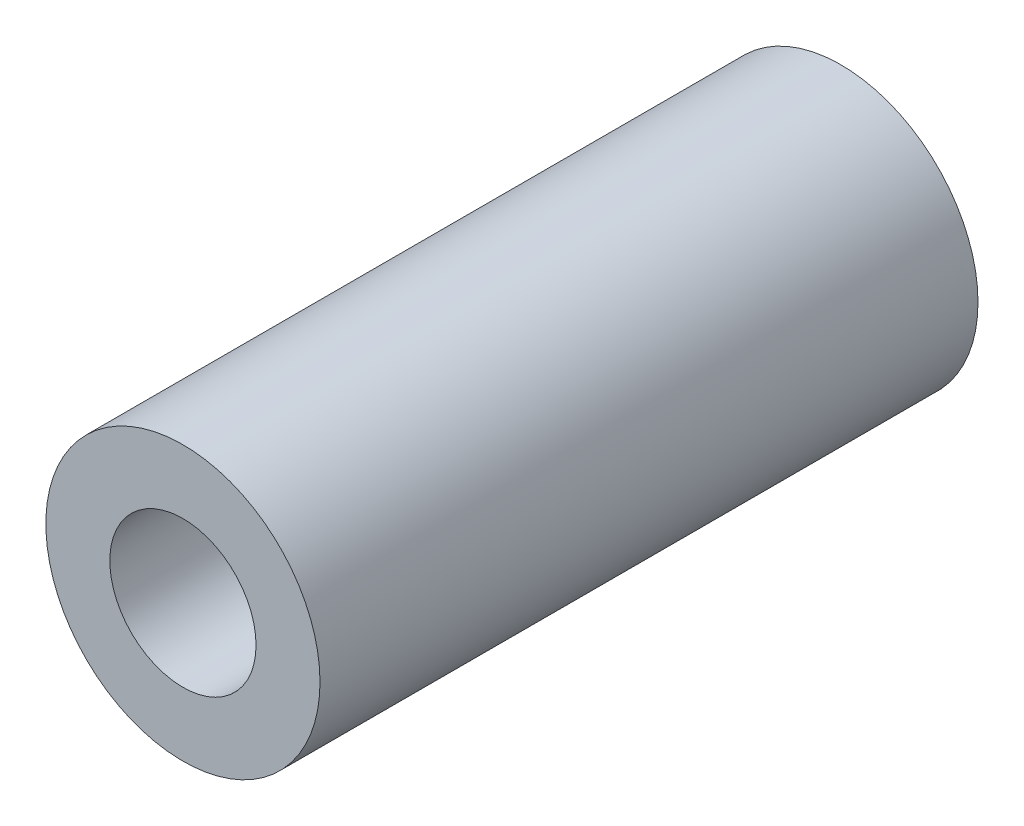
ISO-10303-21;
HEADER;
FILE_DESCRIPTION(('STEP AP214'),'2;1');
FILE_NAME('part.step','',(''),(''),'','','');
FILE_SCHEMA(('AUTOMOTIVE_DESIGN { 1 0 10303 214 1 1 1 1 }'));
ENDSEC;
DATA;
#1=APPLICATION_CONTEXT('core data for automotive mechanical design processes');
#2=APPLICATION_PROTOCOL_DEFINITION('international standard','automotive_design',2000,#1);
#3=PRODUCT_CONTEXT('',#1,'mechanical');
#4=PRODUCT('Part','Part','',(#3));
#5=PRODUCT_RELATED_PRODUCT_CATEGORY('part','',(#4));
#6=PRODUCT_DEFINITION_FORMATION('','',#4);
#7=PRODUCT_DEFINITION_CONTEXT('part definition',#1,'design');
#8=PRODUCT_DEFINITION('design','',#6,#7);
#9=PRODUCT_DEFINITION_SHAPE('','',#8);
#10=(LENGTH_UNIT() NAMED_UNIT(*) SI_UNIT(.MILLI.,.METRE.));
#11=(NAMED_UNIT(*) PLANE_ANGLE_UNIT() SI_UNIT($,.RADIAN.));
#12=(NAMED_UNIT(*) SI_UNIT($,.STERADIAN.) SOLID_ANGLE_UNIT());
#13=UNCERTAINTY_MEASURE_WITH_UNIT(LENGTH_MEASURE(1.E-05),#10,'distance_accuracy_value','');
#14=(GEOMETRIC_REPRESENTATION_CONTEXT(3) GLOBAL_UNCERTAINTY_ASSIGNED_CONTEXT((#13)) GLOBAL_UNIT_ASSIGNED_CONTEXT((#10,
#11,#12)) REPRESENTATION_CONTEXT('',''));
#15=CARTESIAN_POINT('',(0.,0.,0.));
#16=DIRECTION('',(0.,0.,1.));
#17=DIRECTION('',(1.,0.,0.));
#18=AXIS2_PLACEMENT_3D('',#15,#16,#17);
#19=CARTESIAN_POINT('',(-17.9008175763552,104.015877234179,91.3353724199519));
#20=DIRECTION('',(0.,0.,1.));
#21=DIRECTION('',(1.,0.,0.));
#22=AXIS2_PLACEMENT_3D('',#19,#20,#21);
#23=PLANE('',#22);
#24=CARTESIAN_POINT('',(-17.9008175763552,104.015877234179,91.3353724199519));
#25=DIRECTION('',(0.,0.,1.));
#26=DIRECTION('',(1.,0.,0.));
#27=AXIS2_PLACEMENT_3D('',#24,#25,#26);
#28=CIRCLE('',#27,3.75);
#29=CARTESIAN_POINT('',(-14.1508175763552,104.015877234179,91.3353724199519));
#30=VERTEX_POINT('',#29);
#31=EDGE_CURVE('E10',#30,#30,#28,.T.);
#32=ORIENTED_EDGE('',*,*,#31,.T.);
#33=EDGE_LOOP('',(#32));
#34=FACE_BOUND('',#33,.T.);
#35=CARTESIAN_POINT('',(-17.9008175763552,104.015877234179,91.3353724199519));
#36=DIRECTION('',(0.,0.,1.));
#37=DIRECTION('',(1.,0.,0.));
#38=AXIS2_PLACEMENT_3D('',#35,#36,#37);
#39=CIRCLE('',#38,2.0000038100075);
#40=CARTESIAN_POINT('',(-15.9008137663477,104.015877234179,91.3353724199519));
#41=VERTEX_POINT('',#40);
#42=EDGE_CURVE('E42',#41,#41,#39,.T.);
#43=ORIENTED_EDGE('',*,*,#42,.F.);
#44=EDGE_LOOP('',(#43));
#45=FACE_BOUND('',#44,.T.);
#46=ADVANCED_FACE('F31',(#34,#45),#23,.T.);
#47=CARTESIAN_POINT('',(-17.9008175763552,104.015877234179,73.3353724199519));
#48=DIRECTION('',(0.,0.,1.));
#49=DIRECTION('',(1.,0.,0.));
#50=AXIS2_PLACEMENT_3D('',#47,#48,#49);
#51=PLANE('',#50);
#52=CARTESIAN_POINT('',(-17.9008175763552,104.015877234179,73.3353724199519));
#53=DIRECTION('',(0.,0.,1.));
#54=DIRECTION('',(1.,0.,0.));
#55=AXIS2_PLACEMENT_3D('',#52,#53,#54);
#56=CIRCLE('',#55,3.75);
#57=CARTESIAN_POINT('',(-14.1508175763552,104.015877234179,73.3353724199519));
#58=VERTEX_POINT('',#57);
#59=EDGE_CURVE('E35',#58,#58,#56,.T.);
#60=ORIENTED_EDGE('',*,*,#59,.F.);
#61=EDGE_LOOP('',(#60));
#62=FACE_BOUND('',#61,.T.);
#63=CARTESIAN_POINT('',(-17.9008175763552,104.015877234179,73.3353724199519));
#64=DIRECTION('',(0.,0.,1.));
#65=DIRECTION('',(1.,0.,0.));
#66=AXIS2_PLACEMENT_3D('',#63,#64,#65);
#67=CIRCLE('',#66,2.0000038100075);
#68=CARTESIAN_POINT('',(-15.9008137663477,104.015877234179,73.3353724199519));
#69=VERTEX_POINT('',#68);
#70=EDGE_CURVE('E44',#69,#69,#67,.T.);
#71=ORIENTED_EDGE('',*,*,#70,.T.);
#72=EDGE_LOOP('',(#71));
#73=FACE_BOUND('',#72,.T.);
#74=ADVANCED_FACE('F54',(#62,#73),#51,.F.);
#75=CARTESIAN_POINT('',(-17.9008175763552,104.015877234179,91.3353724199519));
#76=DIRECTION('',(0.,0.,-1.));
#77=DIRECTION('',(-1.,0.,0.));
#78=AXIS2_PLACEMENT_3D('',#75,#76,#77);
#79=CYLINDRICAL_SURFACE('',#78,3.75);
#80=ORIENTED_EDGE('',*,*,#31,.F.);
#81=EDGE_LOOP('',(#80));
#82=FACE_BOUND('',#81,.T.);
#83=ORIENTED_EDGE('',*,*,#59,.T.);
#84=EDGE_LOOP('',(#83));
#85=FACE_BOUND('',#84,.T.);
#86=ADVANCED_FACE('F33',(#82,#85),#79,.T.);
#87=CARTESIAN_POINT('',(-17.9008175763552,104.015877234179,91.3353724199519));
#88=DIRECTION('',(0.,0.,-1.));
#89=DIRECTION('',(-1.,0.,0.));
#90=AXIS2_PLACEMENT_3D('',#87,#88,#89);
#91=CYLINDRICAL_SURFACE('',#90,2.0000038100075);
#92=ORIENTED_EDGE('',*,*,#42,.T.);
#93=EDGE_LOOP('',(#92));
#94=FACE_BOUND('',#93,.T.);
#95=ORIENTED_EDGE('',*,*,#70,.F.);
#96=EDGE_LOOP('',(#95));
#97=FACE_BOUND('',#96,.T.);
#98=ADVANCED_FACE('F50',(#94,#97),#91,.F.);
#99=CLOSED_SHELL('',(#46,#74,#86,#98));
#100=MANIFOLD_SOLID_BREP('B2',#99);
#101=ADVANCED_BREP_SHAPE_REPRESENTATION('',(#18,#100),#14);
#102=SHAPE_DEFINITION_REPRESENTATION(#9,#101);
ENDSEC;
END-ISO-10303-21;
